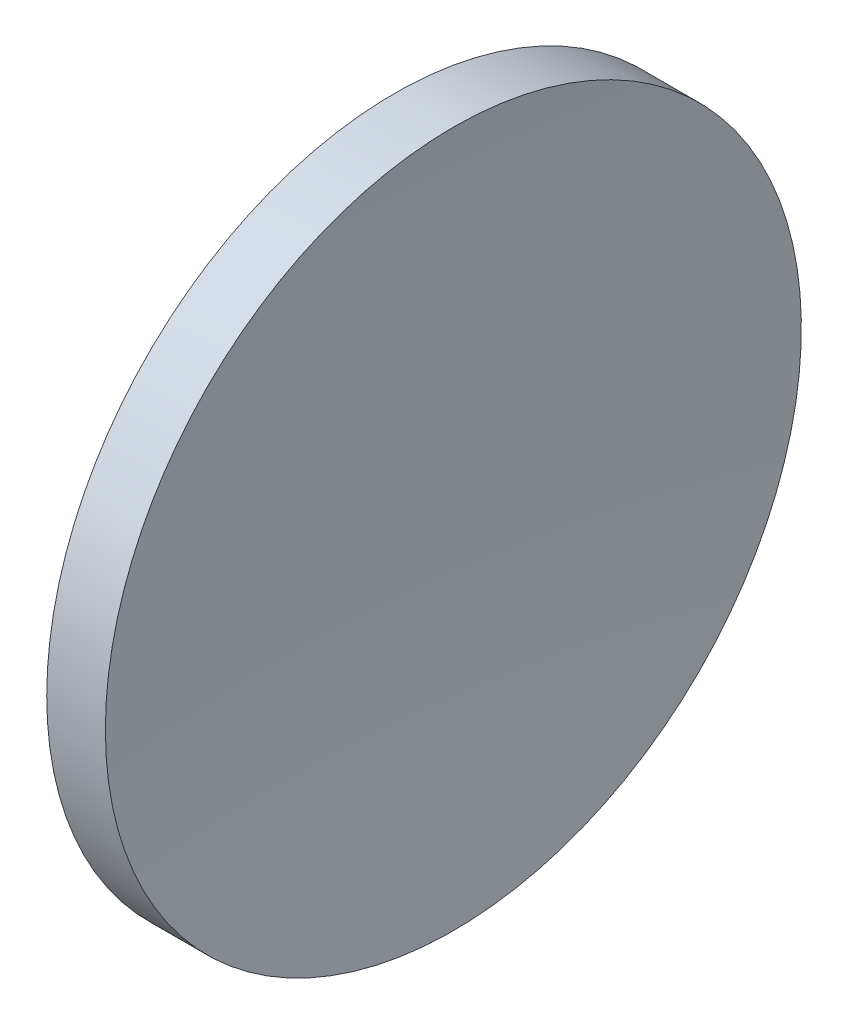
ISO-10303-21;
HEADER;
FILE_DESCRIPTION(('STEP AP214'),'2;1');
FILE_NAME('part.step','',(''),(''),'','','');
FILE_SCHEMA(('AUTOMOTIVE_DESIGN { 1 0 10303 214 1 1 1 1 }'));
ENDSEC;
DATA;
#1=APPLICATION_CONTEXT('core data for automotive mechanical design processes');
#2=APPLICATION_PROTOCOL_DEFINITION('international standard','automotive_design',2000,#1);
#3=PRODUCT_CONTEXT('',#1,'mechanical');
#4=PRODUCT('Part','Part','',(#3));
#5=PRODUCT_RELATED_PRODUCT_CATEGORY('part','',(#4));
#6=PRODUCT_DEFINITION_FORMATION('','',#4);
#7=PRODUCT_DEFINITION_CONTEXT('part definition',#1,'design');
#8=PRODUCT_DEFINITION('design','',#6,#7);
#9=PRODUCT_DEFINITION_SHAPE('','',#8);
#10=(LENGTH_UNIT() NAMED_UNIT(*) SI_UNIT(.MILLI.,.METRE.));
#11=(NAMED_UNIT(*) PLANE_ANGLE_UNIT() SI_UNIT($,.RADIAN.));
#12=(NAMED_UNIT(*) SI_UNIT($,.STERADIAN.) SOLID_ANGLE_UNIT());
#13=UNCERTAINTY_MEASURE_WITH_UNIT(LENGTH_MEASURE(1.E-05),#10,'distance_accuracy_value','');
#14=(GEOMETRIC_REPRESENTATION_CONTEXT(3) GLOBAL_UNCERTAINTY_ASSIGNED_CONTEXT((#13)) GLOBAL_UNIT_ASSIGNED_CONTEXT((#10,
#11,#12)) REPRESENTATION_CONTEXT('',''));
#15=CARTESIAN_POINT('',(0.,0.,0.));
#16=DIRECTION('',(0.,0.,1.));
#17=DIRECTION('',(1.,0.,0.));
#18=AXIS2_PLACEMENT_3D('',#15,#16,#17);
#19=CARTESIAN_POINT('',(374.919437134644,65.1556304570149,0.));
#20=DIRECTION('',(-1.,0.,0.));
#21=DIRECTION('',(0.,1.,0.));
#22=AXIS2_PLACEMENT_3D('',#19,#20,#21);
#23=SPHERICAL_SURFACE('',#22,258.18);
#24=CARTESIAN_POINT('',(117.952683643068,65.1556304570152,0.));
#25=DIRECTION('',(-1.,0.,0.));
#26=DIRECTION('',(0.,0.,1.));
#27=AXIS2_PLACEMENT_3D('',#24,#25,#26);
#28=CIRCLE('',#27,25.);
#29=CARTESIAN_POINT('',(117.952683643068,65.1556304570152,25.));
#30=VERTEX_POINT('',#29);
#31=EDGE_CURVE('E10',#30,#30,#28,.T.);
#32=ORIENTED_EDGE('',*,*,#31,.F.);
#33=EDGE_LOOP('',(#32));
#34=FACE_BOUND('',#33,.T.);
#35=ADVANCED_FACE('F35',(#34),#23,.F.);
#36=CARTESIAN_POINT('',(105.62183712383,65.1556304570152,0.));
#37=DIRECTION('',(-1.,0.,0.));
#38=DIRECTION('',(0.,0.,1.));
#39=AXIS2_PLACEMENT_3D('',#36,#37,#38);
#40=CYLINDRICAL_SURFACE('',#39,25.);
#41=CARTESIAN_POINT('',(113.739437134643,65.1556304570152,0.));
#42=DIRECTION('',(-1.,0.,0.));
#43=DIRECTION('',(0.,0.,1.));
#44=AXIS2_PLACEMENT_3D('',#41,#42,#43);
#45=CIRCLE('',#44,25.);
#46=CARTESIAN_POINT('',(113.739437134643,65.1556304570152,25.));
#47=VERTEX_POINT('',#46);
#48=EDGE_CURVE('E41',#47,#47,#45,.T.);
#49=ORIENTED_EDGE('',*,*,#48,.F.);
#50=EDGE_LOOP('',(#49));
#51=FACE_BOUND('',#50,.T.);
#52=ORIENTED_EDGE('',*,*,#31,.T.);
#53=EDGE_LOOP('',(#52));
#54=FACE_BOUND('',#53,.T.);
#55=ADVANCED_FACE('F49',(#51,#54),#40,.T.);
#56=CARTESIAN_POINT('',(113.739437134643,65.1556304570152,0.));
#57=DIRECTION('',(1.,0.,0.));
#58=DIRECTION('',(0.,0.,-1.));
#59=AXIS2_PLACEMENT_3D('',#56,#57,#58);
#60=PLANE('',#59);
#61=ORIENTED_EDGE('',*,*,#48,.T.);
#62=EDGE_LOOP('',(#61));
#63=FACE_BOUND('',#62,.T.);
#64=ADVANCED_FACE('F47',(#63),#60,.F.);
#65=CLOSED_SHELL('',(#35,#55,#64));
#66=MANIFOLD_SOLID_BREP('B2',#65);
#67=ADVANCED_BREP_SHAPE_REPRESENTATION('',(#18,#66),#14);
#68=SHAPE_DEFINITION_REPRESENTATION(#9,#67);
ENDSEC;
END-ISO-10303-21;
